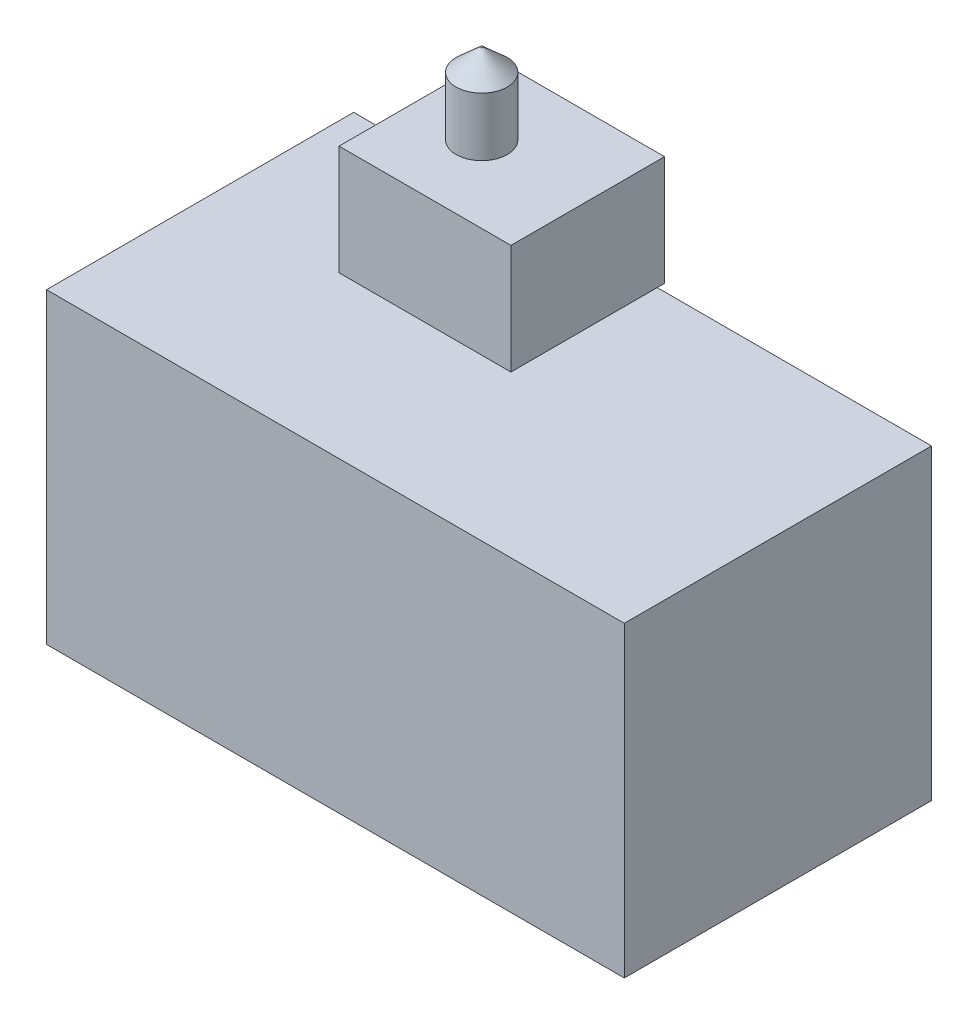
ISO-10303-21;
HEADER;
FILE_DESCRIPTION(('STEP AP214'),'2;1');
FILE_NAME('part.step','',(''),(''),'','','');
FILE_SCHEMA(('AUTOMOTIVE_DESIGN { 1 0 10303 214 1 1 1 1 }'));
ENDSEC;
DATA;
#1=APPLICATION_CONTEXT('core data for automotive mechanical design processes');
#2=APPLICATION_PROTOCOL_DEFINITION('international standard','automotive_design',2000,#1);
#3=PRODUCT_CONTEXT('',#1,'mechanical');
#4=PRODUCT('Part','Part','',(#3));
#5=PRODUCT_RELATED_PRODUCT_CATEGORY('part','',(#4));
#6=PRODUCT_DEFINITION_FORMATION('','',#4);
#7=PRODUCT_DEFINITION_CONTEXT('part definition',#1,'design');
#8=PRODUCT_DEFINITION('design','',#6,#7);
#9=PRODUCT_DEFINITION_SHAPE('','',#8);
#10=(LENGTH_UNIT() NAMED_UNIT(*) SI_UNIT(.MILLI.,.METRE.));
#11=(NAMED_UNIT(*) PLANE_ANGLE_UNIT() SI_UNIT($,.RADIAN.));
#12=(NAMED_UNIT(*) SI_UNIT($,.STERADIAN.) SOLID_ANGLE_UNIT());
#13=UNCERTAINTY_MEASURE_WITH_UNIT(LENGTH_MEASURE(1.E-05),#10,'distance_accuracy_value','');
#14=(GEOMETRIC_REPRESENTATION_CONTEXT(3) GLOBAL_UNCERTAINTY_ASSIGNED_CONTEXT((#13)) GLOBAL_UNIT_ASSIGNED_CONTEXT((#10,
#11,#12)) REPRESENTATION_CONTEXT('',''));
#15=CARTESIAN_POINT('',(0.,0.,0.));
#16=DIRECTION('',(0.,0.,1.));
#17=DIRECTION('',(1.,0.,0.));
#18=AXIS2_PLACEMENT_3D('',#15,#16,#17);
#19=CARTESIAN_POINT('',(32.,70.,14.5));
#20=DIRECTION('',(0.,-1.,0.));
#21=DIRECTION('',(0.,0.,-1.));
#22=AXIS2_PLACEMENT_3D('',#19,#20,#21);
#23=CYLINDRICAL_SURFACE('',#22,3.5);
#24=CARTESIAN_POINT('',(32.,70.,14.5));
#25=DIRECTION('',(0.,1.,0.));
#26=DIRECTION('',(0.,0.,1.));
#27=AXIS2_PLACEMENT_3D('',#24,#25,#26);
#28=CIRCLE('',#27,3.5);
#29=CARTESIAN_POINT('',(32.,70.,18.));
#30=VERTEX_POINT('',#29);
#31=EDGE_CURVE('E11',#30,#30,#28,.T.);
#32=ORIENTED_EDGE('',*,*,#31,.F.);
#33=EDGE_LOOP('',(#32));
#34=FACE_BOUND('',#33,.T.);
#35=CARTESIAN_POINT('',(32.,62.,14.5));
#36=DIRECTION('',(0.,1.,0.));
#37=DIRECTION('',(0.,0.,1.));
#38=AXIS2_PLACEMENT_3D('',#35,#36,#37);
#39=CIRCLE('',#38,3.5);
#40=CARTESIAN_POINT('',(32.,62.,18.));
#41=VERTEX_POINT('',#40);
#42=EDGE_CURVE('E50',#41,#41,#39,.T.);
#43=ORIENTED_EDGE('',*,*,#42,.T.);
#44=EDGE_LOOP('',(#43));
#45=FACE_BOUND('',#44,.T.);
#46=ADVANCED_FACE('F47',(#34,#45),#23,.T.);
#47=CARTESIAN_POINT('',(32.,62.,14.5));
#48=DIRECTION('',(0.,1.,0.));
#49=DIRECTION('',(0.,0.,1.));
#50=AXIS2_PLACEMENT_3D('',#47,#48,#49);
#51=PLANE('',#50);
#52=ORIENTED_EDGE('',*,*,#42,.F.);
#53=EDGE_LOOP('',(#52));
#54=FACE_BOUND('',#53,.T.);
#55=ADVANCED_FACE('F66',(#54),#51,.F.);
#56=CARTESIAN_POINT('',(32.,73.,14.5));
#57=DIRECTION('',(0.,1.,0.));
#58=DIRECTION('',(0.,0.,1.));
#59=AXIS2_PLACEMENT_3D('',#56,#57,#58);
#60=PLANE('',#59);
#61=CARTESIAN_POINT('',(32.,73.,14.5));
#62=DIRECTION('',(0.,-1.,0.));
#63=DIRECTION('',(0.,0.,-1.));
#64=AXIS2_PLACEMENT_3D('',#61,#62,#63);
#65=CIRCLE('',#64,0.149999999999997);
#66=CARTESIAN_POINT('',(32.,73.,14.35));
#67=VERTEX_POINT('',#66);
#68=EDGE_CURVE('E57',#67,#67,#65,.T.);
#69=ORIENTED_EDGE('',*,*,#68,.F.);
#70=EDGE_LOOP('',(#69));
#71=FACE_BOUND('',#70,.T.);
#72=ADVANCED_FACE('F64',(#71),#60,.T.);
#73=CARTESIAN_POINT('',(32.,70.,14.5));
#74=DIRECTION('',(0.,-1.,0.));
#75=DIRECTION('',(0.,0.,-1.));
#76=AXIS2_PLACEMENT_3D('',#73,#74,#75);
#77=CONICAL_SURFACE('',#76,3.5,0.840460558771118);
#78=ORIENTED_EDGE('',*,*,#68,.T.);
#79=EDGE_LOOP('',(#78));
#80=FACE_BOUND('',#79,.T.);
#81=ORIENTED_EDGE('',*,*,#31,.T.);
#82=EDGE_LOOP('',(#81));
#83=FACE_BOUND('',#82,.T.);
#84=ADVANCED_FACE('F62',(#80,#83),#77,.T.);
#85=CLOSED_SHELL('',(#46,#55,#72,#84));
#86=MANIFOLD_SOLID_BREP('B2',#85);
#87=CARTESIAN_POINT('',(0.,42.,42.));
#88=DIRECTION('',(0.,1.,0.));
#89=DIRECTION('',(0.,0.,1.));
#90=AXIS2_PLACEMENT_3D('',#87,#88,#89);
#91=PLANE('',#90);
#92=DIRECTION('',(1.,0.,0.));
#93=VECTOR('',#92,1.);
#94=CARTESIAN_POINT('',(0.,42.,0.));
#95=LINE('',#94,#93);
#96=CARTESIAN_POINT('',(0.,42.,0.));
#97=VERTEX_POINT('',#96);
#98=CARTESIAN_POINT('',(79.,42.,0.));
#99=VERTEX_POINT('',#98);
#100=EDGE_CURVE('E233',#97,#99,#95,.T.);
#101=ORIENTED_EDGE('',*,*,#100,.F.);
#102=DIRECTION('',(0.,0.,-1.));
#103=VECTOR('',#102,1.);
#104=CARTESIAN_POINT('',(0.,42.,42.));
#105=LINE('',#104,#103);
#106=CARTESIAN_POINT('',(0.,42.,42.));
#107=VERTEX_POINT('',#106);
#108=EDGE_CURVE('E107',#107,#97,#105,.T.);
#109=ORIENTED_EDGE('',*,*,#108,.F.);
#110=DIRECTION('',(1.,0.,0.));
#111=VECTOR('',#110,1.);
#112=CARTESIAN_POINT('',(0.,42.,42.));
#113=LINE('',#112,#111);
#114=CARTESIAN_POINT('',(79.,42.,42.));
#115=VERTEX_POINT('',#114);
#116=EDGE_CURVE('E221',#107,#115,#113,.T.);
#117=ORIENTED_EDGE('',*,*,#116,.T.);
#118=DIRECTION('',(0.,0.,-1.));
#119=VECTOR('',#118,1.);
#120=CARTESIAN_POINT('',(79.,42.,42.));
#121=LINE('',#120,#119);
#122=EDGE_CURVE('E244',#115,#99,#121,.T.);
#123=ORIENTED_EDGE('',*,*,#122,.T.);
#124=EDGE_LOOP('',(#101,#109,#117,#123));
#125=FACE_BOUND('',#124,.T.);
#126=CARTESIAN_POINT('',(32.,42.,14.5));
#127=DIRECTION('',(0.,1.,0.));
#128=DIRECTION('',(0.,0.,1.));
#129=AXIS2_PLACEMENT_3D('',#126,#127,#128);
#130=CIRCLE('',#129,3.5);
#131=CARTESIAN_POINT('',(32.,42.,18.));
#132=VERTEX_POINT('',#131);
#133=EDGE_CURVE('E203',#132,#132,#130,.T.);
#134=ORIENTED_EDGE('',*,*,#133,.F.);
#135=EDGE_LOOP('',(#134));
#136=FACE_BOUND('',#135,.T.);
#137=ADVANCED_FACE('F103',(#125,#136),#91,.T.);
#138=CARTESIAN_POINT('',(0.,0.,42.));
#139=DIRECTION('',(-1.,0.,0.));
#140=DIRECTION('',(0.,0.,1.));
#141=AXIS2_PLACEMENT_3D('',#138,#139,#140);
#142=PLANE('',#141);
#143=DIRECTION('',(0.,1.,0.));
#144=VECTOR('',#143,1.);
#145=CARTESIAN_POINT('',(0.,0.,0.));
#146=LINE('',#145,#144);
#147=CARTESIAN_POINT('',(0.,0.,0.));
#148=VERTEX_POINT('',#147);
#149=EDGE_CURVE('E217',#148,#97,#146,.T.);
#150=ORIENTED_EDGE('',*,*,#149,.F.);
#151=DIRECTION('',(0.,0.,-1.));
#152=VECTOR('',#151,1.);
#153=CARTESIAN_POINT('',(0.,0.,42.));
#154=LINE('',#153,#152);
#155=CARTESIAN_POINT('',(0.,0.,42.));
#156=VERTEX_POINT('',#155);
#157=EDGE_CURVE('E45',#156,#148,#154,.T.);
#158=ORIENTED_EDGE('',*,*,#157,.F.);
#159=DIRECTION('',(0.,1.,0.));
#160=VECTOR('',#159,1.);
#161=CARTESIAN_POINT('',(0.,0.,42.));
#162=LINE('',#161,#160);
#163=EDGE_CURVE('E218',#156,#107,#162,.T.);
#164=ORIENTED_EDGE('',*,*,#163,.T.);
#165=ORIENTED_EDGE('',*,*,#108,.T.);
#166=EDGE_LOOP('',(#150,#158,#164,#165));
#167=FACE_BOUND('',#166,.T.);
#168=ADVANCED_FACE('F105',(#167),#142,.T.);
#169=CARTESIAN_POINT('',(0.,0.,42.));
#170=DIRECTION('',(0.,1.,0.));
#171=DIRECTION('',(0.,0.,1.));
#172=AXIS2_PLACEMENT_3D('',#169,#170,#171);
#173=PLANE('',#172);
#174=DIRECTION('',(1.,0.,0.));
#175=VECTOR('',#174,1.);
#176=CARTESIAN_POINT('',(0.,0.,0.));
#177=LINE('',#176,#175);
#178=CARTESIAN_POINT('',(79.,0.,0.));
#179=VERTEX_POINT('',#178);
#180=EDGE_CURVE('E139',#148,#179,#177,.T.);
#181=ORIENTED_EDGE('',*,*,#180,.T.);
#182=DIRECTION('',(0.,0.,-1.));
#183=VECTOR('',#182,1.);
#184=CARTESIAN_POINT('',(79.,0.,42.));
#185=LINE('',#184,#183);
#186=CARTESIAN_POINT('',(79.,0.,42.));
#187=VERTEX_POINT('',#186);
#188=EDGE_CURVE('E114',#187,#179,#185,.T.);
#189=ORIENTED_EDGE('',*,*,#188,.F.);
#190=DIRECTION('',(1.,0.,0.));
#191=VECTOR('',#190,1.);
#192=CARTESIAN_POINT('',(0.,0.,42.));
#193=LINE('',#192,#191);
#194=EDGE_CURVE('E227',#156,#187,#193,.T.);
#195=ORIENTED_EDGE('',*,*,#194,.F.);
#196=ORIENTED_EDGE('',*,*,#157,.T.);
#197=EDGE_LOOP('',(#181,#189,#195,#196));
#198=FACE_BOUND('',#197,.T.);
#199=ADVANCED_FACE('F256',(#198),#173,.F.);
#200=CARTESIAN_POINT('',(79.,0.,42.));
#201=DIRECTION('',(-1.,0.,0.));
#202=DIRECTION('',(0.,0.,1.));
#203=AXIS2_PLACEMENT_3D('',#200,#201,#202);
#204=PLANE('',#203);
#205=DIRECTION('',(0.,1.,0.));
#206=VECTOR('',#205,1.);
#207=CARTESIAN_POINT('',(79.,0.,0.));
#208=LINE('',#207,#206);
#209=EDGE_CURVE('E237',#179,#99,#208,.T.);
#210=ORIENTED_EDGE('',*,*,#209,.T.);
#211=ORIENTED_EDGE('',*,*,#122,.F.);
#212=DIRECTION('',(0.,1.,0.));
#213=VECTOR('',#212,1.);
#214=CARTESIAN_POINT('',(79.,0.,42.));
#215=LINE('',#214,#213);
#216=EDGE_CURVE('E224',#187,#115,#215,.T.);
#217=ORIENTED_EDGE('',*,*,#216,.F.);
#218=ORIENTED_EDGE('',*,*,#188,.T.);
#219=EDGE_LOOP('',(#210,#211,#217,#218));
#220=FACE_BOUND('',#219,.T.);
#221=ADVANCED_FACE('F254',(#220),#204,.F.);
#222=CARTESIAN_POINT('',(0.,0.,42.));
#223=DIRECTION('',(0.,0.,-1.));
#224=DIRECTION('',(-1.,0.,0.));
#225=AXIS2_PLACEMENT_3D('',#222,#223,#224);
#226=PLANE('',#225);
#227=ORIENTED_EDGE('',*,*,#163,.F.);
#228=ORIENTED_EDGE('',*,*,#194,.T.);
#229=ORIENTED_EDGE('',*,*,#216,.T.);
#230=ORIENTED_EDGE('',*,*,#116,.F.);
#231=EDGE_LOOP('',(#227,#228,#229,#230));
#232=FACE_BOUND('',#231,.T.);
#233=ADVANCED_FACE('F258',(#232),#226,.F.);
#234=CARTESIAN_POINT('',(0.,0.,0.));
#235=DIRECTION('',(0.,0.,-1.));
#236=DIRECTION('',(-1.,0.,0.));
#237=AXIS2_PLACEMENT_3D('',#234,#235,#236);
#238=PLANE('',#237);
#239=ORIENTED_EDGE('',*,*,#149,.T.);
#240=ORIENTED_EDGE('',*,*,#100,.T.);
#241=ORIENTED_EDGE('',*,*,#209,.F.);
#242=ORIENTED_EDGE('',*,*,#180,.F.);
#243=EDGE_LOOP('',(#239,#240,#241,#242));
#244=FACE_BOUND('',#243,.T.);
#245=ADVANCED_FACE('F252',(#244),#238,.T.);
#246=CARTESIAN_POINT('',(32.,56.8994949366117,14.5));
#247=DIRECTION('',(0.,-1.,0.));
#248=DIRECTION('',(0.,0.,-1.));
#249=AXIS2_PLACEMENT_3D('',#246,#247,#248);
#250=CYLINDRICAL_SURFACE('',#249,3.5);
#251=ORIENTED_EDGE('',*,*,#133,.T.);
#252=EDGE_LOOP('',(#251));
#253=FACE_BOUND('',#252,.T.);
#254=CARTESIAN_POINT('',(32.,47.,14.5));
#255=DIRECTION('',(0.,1.,0.));
#256=DIRECTION('',(0.,0.,1.));
#257=AXIS2_PLACEMENT_3D('',#254,#255,#256);
#258=CIRCLE('',#257,3.5);
#259=CARTESIAN_POINT('',(32.,47.,18.));
#260=VERTEX_POINT('',#259);
#261=EDGE_CURVE('E208',#260,#260,#258,.T.);
#262=ORIENTED_EDGE('',*,*,#261,.F.);
#263=EDGE_LOOP('',(#262));
#264=FACE_BOUND('',#263,.T.);
#265=ADVANCED_FACE('F265',(#253,#264),#250,.T.);
#266=CARTESIAN_POINT('',(0.,47.,0.));
#267=DIRECTION('',(0.,1.,0.));
#268=DIRECTION('',(0.,0.,1.));
#269=AXIS2_PLACEMENT_3D('',#266,#267,#268);
#270=PLANE('',#269);
#271=DIRECTION('',(0.,0.,1.));
#272=VECTOR('',#271,1.);
#273=CARTESIAN_POINT('',(23.,47.,4.));
#274=LINE('',#273,#272);
#275=CARTESIAN_POINT('',(23.,47.,4.));
#276=VERTEX_POINT('',#275);
#277=CARTESIAN_POINT('',(23.,47.,25.));
#278=VERTEX_POINT('',#277);
#279=EDGE_CURVE('E201',#276,#278,#274,.T.);
#280=ORIENTED_EDGE('',*,*,#279,.F.);
#281=DIRECTION('',(-1.,0.,0.));
#282=VECTOR('',#281,1.);
#283=CARTESIAN_POINT('',(23.,47.,4.));
#284=LINE('',#283,#282);
#285=CARTESIAN_POINT('',(46.5,47.,4.));
#286=VERTEX_POINT('',#285);
#287=EDGE_CURVE('E197',#286,#276,#284,.T.);
#288=ORIENTED_EDGE('',*,*,#287,.F.);
#289=DIRECTION('',(0.,0.,-1.));
#290=VECTOR('',#289,1.);
#291=CARTESIAN_POINT('',(46.5,47.,4.));
#292=LINE('',#291,#290);
#293=CARTESIAN_POINT('',(46.5,47.,25.));
#294=VERTEX_POINT('',#293);
#295=EDGE_CURVE('E369',#294,#286,#292,.T.);
#296=ORIENTED_EDGE('',*,*,#295,.F.);
#297=DIRECTION('',(1.,0.,0.));
#298=VECTOR('',#297,1.);
#299=CARTESIAN_POINT('',(23.,47.,25.));
#300=LINE('',#299,#298);
#301=EDGE_CURVE('E374',#278,#294,#300,.T.);
#302=ORIENTED_EDGE('',*,*,#301,.F.);
#303=EDGE_LOOP('',(#280,#288,#296,#302));
#304=FACE_BOUND('',#303,.T.);
#305=ORIENTED_EDGE('',*,*,#261,.T.);
#306=EDGE_LOOP('',(#305));
#307=FACE_BOUND('',#306,.T.);
#308=ADVANCED_FACE('F307',(#304,#307),#270,.F.);
#309=CARTESIAN_POINT('',(23.,62.,4.));
#310=DIRECTION('',(1.,0.,0.));
#311=DIRECTION('',(0.,0.,-1.));
#312=AXIS2_PLACEMENT_3D('',#309,#310,#311);
#313=PLANE('',#312);
#314=ORIENTED_EDGE('',*,*,#279,.T.);
#315=DIRECTION('',(0.,-1.,0.));
#316=VECTOR('',#315,1.);
#317=CARTESIAN_POINT('',(23.,62.,25.));
#318=LINE('',#317,#316);
#319=CARTESIAN_POINT('',(23.,62.,25.));
#320=VERTEX_POINT('',#319);
#321=EDGE_CURVE('E179',#320,#278,#318,.T.);
#322=ORIENTED_EDGE('',*,*,#321,.F.);
#323=DIRECTION('',(0.,0.,1.));
#324=VECTOR('',#323,1.);
#325=CARTESIAN_POINT('',(23.,62.,4.));
#326=LINE('',#325,#324);
#327=CARTESIAN_POINT('',(23.,62.,4.));
#328=VERTEX_POINT('',#327);
#329=EDGE_CURVE('E187',#328,#320,#326,.T.);
#330=ORIENTED_EDGE('',*,*,#329,.F.);
#331=DIRECTION('',(0.,-1.,0.));
#332=VECTOR('',#331,1.);
#333=CARTESIAN_POINT('',(23.,62.,4.));
#334=LINE('',#333,#332);
#335=EDGE_CURVE('E365',#328,#276,#334,.T.);
#336=ORIENTED_EDGE('',*,*,#335,.T.);
#337=EDGE_LOOP('',(#314,#322,#330,#336));
#338=FACE_BOUND('',#337,.T.);
#339=ADVANCED_FACE('F199',(#338),#313,.F.);
#340=CARTESIAN_POINT('',(23.,62.,25.));
#341=DIRECTION('',(0.,0.,-1.));
#342=DIRECTION('',(-1.,0.,0.));
#343=AXIS2_PLACEMENT_3D('',#340,#341,#342);
#344=PLANE('',#343);
#345=ORIENTED_EDGE('',*,*,#301,.T.);
#346=DIRECTION('',(0.,-1.,0.));
#347=VECTOR('',#346,1.);
#348=CARTESIAN_POINT('',(46.5,62.,25.));
#349=LINE('',#348,#347);
#350=CARTESIAN_POINT('',(46.5,62.,25.));
#351=VERTEX_POINT('',#350);
#352=EDGE_CURVE('E182',#351,#294,#349,.T.);
#353=ORIENTED_EDGE('',*,*,#352,.F.);
#354=DIRECTION('',(1.,0.,0.));
#355=VECTOR('',#354,1.);
#356=CARTESIAN_POINT('',(23.,62.,25.));
#357=LINE('',#356,#355);
#358=EDGE_CURVE('E175',#320,#351,#357,.T.);
#359=ORIENTED_EDGE('',*,*,#358,.F.);
#360=ORIENTED_EDGE('',*,*,#321,.T.);
#361=EDGE_LOOP('',(#345,#353,#359,#360));
#362=FACE_BOUND('',#361,.T.);
#363=ADVANCED_FACE('F177',(#362),#344,.F.);
#364=CARTESIAN_POINT('',(46.5,62.,4.));
#365=DIRECTION('',(-1.,0.,0.));
#366=DIRECTION('',(0.,0.,1.));
#367=AXIS2_PLACEMENT_3D('',#364,#365,#366);
#368=PLANE('',#367);
#369=ORIENTED_EDGE('',*,*,#295,.T.);
#370=DIRECTION('',(0.,-1.,0.));
#371=VECTOR('',#370,1.);
#372=CARTESIAN_POINT('',(46.5,62.,4.));
#373=LINE('',#372,#371);
#374=CARTESIAN_POINT('',(46.5,62.,4.));
#375=VERTEX_POINT('',#374);
#376=EDGE_CURVE('E210',#375,#286,#373,.T.);
#377=ORIENTED_EDGE('',*,*,#376,.F.);
#378=DIRECTION('',(0.,0.,-1.));
#379=VECTOR('',#378,1.);
#380=CARTESIAN_POINT('',(46.5,62.,4.));
#381=LINE('',#380,#379);
#382=EDGE_CURVE('E186',#351,#375,#381,.T.);
#383=ORIENTED_EDGE('',*,*,#382,.F.);
#384=ORIENTED_EDGE('',*,*,#352,.T.);
#385=EDGE_LOOP('',(#369,#377,#383,#384));
#386=FACE_BOUND('',#385,.T.);
#387=ADVANCED_FACE('F333',(#386),#368,.F.);
#388=CARTESIAN_POINT('',(23.,62.,4.));
#389=DIRECTION('',(0.,0.,1.));
#390=DIRECTION('',(1.,0.,0.));
#391=AXIS2_PLACEMENT_3D('',#388,#389,#390);
#392=PLANE('',#391);
#393=ORIENTED_EDGE('',*,*,#287,.T.);
#394=ORIENTED_EDGE('',*,*,#335,.F.);
#395=DIRECTION('',(-1.,0.,0.));
#396=VECTOR('',#395,1.);
#397=CARTESIAN_POINT('',(23.,62.,4.));
#398=LINE('',#397,#396);
#399=EDGE_CURVE('E192',#375,#328,#398,.T.);
#400=ORIENTED_EDGE('',*,*,#399,.F.);
#401=ORIENTED_EDGE('',*,*,#376,.T.);
#402=EDGE_LOOP('',(#393,#394,#400,#401));
#403=FACE_BOUND('',#402,.T.);
#404=ADVANCED_FACE('F342',(#403),#392,.F.);
#405=CARTESIAN_POINT('',(0.,62.,0.));
#406=DIRECTION('',(0.,1.,0.));
#407=DIRECTION('',(0.,0.,1.));
#408=AXIS2_PLACEMENT_3D('',#405,#406,#407);
#409=PLANE('',#408);
#410=ORIENTED_EDGE('',*,*,#329,.T.);
#411=ORIENTED_EDGE('',*,*,#358,.T.);
#412=ORIENTED_EDGE('',*,*,#382,.T.);
#413=ORIENTED_EDGE('',*,*,#399,.T.);
#414=EDGE_LOOP('',(#410,#411,#412,#413));
#415=FACE_BOUND('',#414,.T.);
#416=ADVANCED_FACE('F190',(#415),#409,.T.);
#417=CLOSED_SHELL('',(#137,#168,#199,#221,#233,#245,#265,#308,#339,#363,#387,#404,#416));
#418=MANIFOLD_SOLID_BREP('B6',#417);
#419=ADVANCED_BREP_SHAPE_REPRESENTATION('',(#18,#86,#418),#14);
#420=SHAPE_DEFINITION_REPRESENTATION(#9,#419);
ENDSEC;
END-ISO-10303-21;
